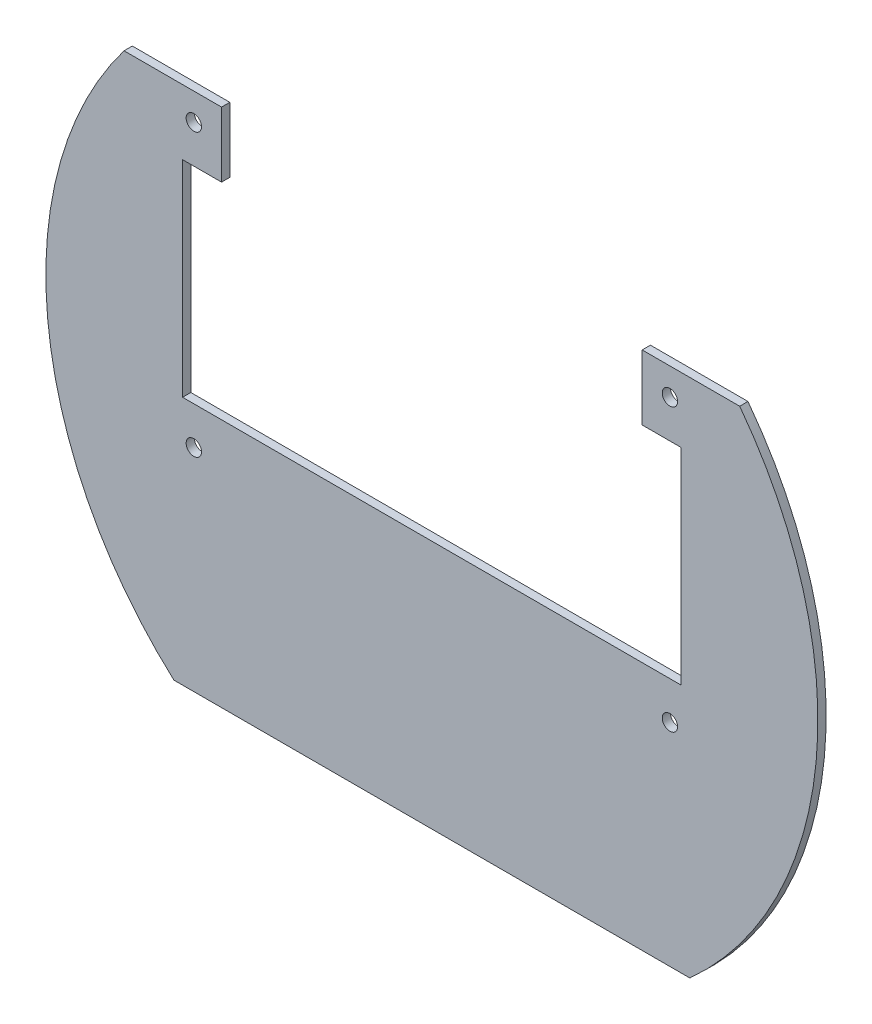
ISO-10303-21;
HEADER;
FILE_DESCRIPTION(('STEP AP214'),'2;1');
FILE_NAME('part.step','',(''),(''),'','','');
FILE_SCHEMA(('AUTOMOTIVE_DESIGN { 1 0 10303 214 1 1 1 1 }'));
ENDSEC;
DATA;
#1=APPLICATION_CONTEXT('core data for automotive mechanical design processes');
#2=APPLICATION_PROTOCOL_DEFINITION('international standard','automotive_design',2000,#1);
#3=PRODUCT_CONTEXT('',#1,'mechanical');
#4=PRODUCT('Part','Part','',(#3));
#5=PRODUCT_RELATED_PRODUCT_CATEGORY('part','',(#4));
#6=PRODUCT_DEFINITION_FORMATION('','',#4);
#7=PRODUCT_DEFINITION_CONTEXT('part definition',#1,'design');
#8=PRODUCT_DEFINITION('design','',#6,#7);
#9=PRODUCT_DEFINITION_SHAPE('','',#8);
#10=(LENGTH_UNIT() NAMED_UNIT(*) SI_UNIT(.MILLI.,.METRE.));
#11=(NAMED_UNIT(*) PLANE_ANGLE_UNIT() SI_UNIT($,.RADIAN.));
#12=(NAMED_UNIT(*) SI_UNIT($,.STERADIAN.) SOLID_ANGLE_UNIT());
#13=UNCERTAINTY_MEASURE_WITH_UNIT(LENGTH_MEASURE(1.E-05),#10,'distance_accuracy_value','');
#14=(GEOMETRIC_REPRESENTATION_CONTEXT(3) GLOBAL_UNCERTAINTY_ASSIGNED_CONTEXT((#13)) GLOBAL_UNIT_ASSIGNED_CONTEXT((#10,
#11,#12)) REPRESENTATION_CONTEXT('',''));
#15=CARTESIAN_POINT('',(0.,0.,0.));
#16=DIRECTION('',(0.,0.,1.));
#17=DIRECTION('',(1.,0.,0.));
#18=AXIS2_PLACEMENT_3D('',#15,#16,#17);
#19=CARTESIAN_POINT('',(0.,0.,1.6129));
#20=DIRECTION('',(0.,0.,1.));
#21=DIRECTION('',(1.,0.,0.));
#22=AXIS2_PLACEMENT_3D('',#19,#20,#21);
#23=PLANE('',#22);
#24=CARTESIAN_POINT('',(-46.5,-14.799999991,1.6129));
#25=DIRECTION('',(0.,0.,1.));
#26=DIRECTION('',(1.,0.,0.));
#27=AXIS2_PLACEMENT_3D('',#24,#25,#26);
#28=CIRCLE('',#27,1.5);
#29=CARTESIAN_POINT('',(-45.,-14.799999991,1.6129));
#30=VERTEX_POINT('',#29);
#31=EDGE_CURVE('E332',#30,#30,#28,.T.);
#32=ORIENTED_EDGE('',*,*,#31,.F.);
#33=EDGE_LOOP('',(#32));
#34=FACE_BOUND('',#33,.T.);
#35=CARTESIAN_POINT('',(46.5,-14.799999991,1.6129));
#36=DIRECTION('',(0.,0.,1.));
#37=DIRECTION('',(1.,0.,0.));
#38=AXIS2_PLACEMENT_3D('',#35,#36,#37);
#39=CIRCLE('',#38,1.5);
#40=CARTESIAN_POINT('',(48.,-14.799999991,1.6129));
#41=VERTEX_POINT('',#40);
#42=EDGE_CURVE('E170',#41,#41,#39,.T.);
#43=ORIENTED_EDGE('',*,*,#42,.F.);
#44=EDGE_LOOP('',(#43));
#45=FACE_BOUND('',#44,.T.);
#46=CARTESIAN_POINT('',(0.,0.,1.6129));
#47=DIRECTION('',(0.,0.,1.));
#48=DIRECTION('',(1.,0.,0.));
#49=AXIS2_PLACEMENT_3D('',#46,#47,#48);
#50=CIRCLE('',#49,75.40625);
#51=CARTESIAN_POINT('',(-60.1319593815344,45.5,1.6129));
#52=VERTEX_POINT('',#51);
#53=CARTESIAN_POINT('',(-50.3874244138605,-56.1,1.6129));
#54=VERTEX_POINT('',#53);
#55=EDGE_CURVE('E200',#52,#54,#50,.T.);
#56=ORIENTED_EDGE('',*,*,#55,.T.);
#57=DIRECTION('',(1.,0.,0.));
#58=VECTOR('',#57,1.);
#59=CARTESIAN_POINT('',(-50.3874244138605,-56.1,1.6129));
#60=LINE('',#59,#58);
#61=CARTESIAN_POINT('',(50.3874244138605,-56.1,1.6129));
#62=VERTEX_POINT('',#61);
#63=EDGE_CURVE('E112',#54,#62,#60,.T.);
#64=ORIENTED_EDGE('',*,*,#63,.T.);
#65=CARTESIAN_POINT('',(0.,0.,1.6129));
#66=DIRECTION('',(0.,0.,1.));
#67=DIRECTION('',(1.,0.,0.));
#68=AXIS2_PLACEMENT_3D('',#65,#66,#67);
#69=CIRCLE('',#68,75.40625);
#70=CARTESIAN_POINT('',(60.1319593815344,45.5,1.6129));
#71=VERTEX_POINT('',#70);
#72=EDGE_CURVE('E237',#62,#71,#69,.T.);
#73=ORIENTED_EDGE('',*,*,#72,.T.);
#74=DIRECTION('',(-1.,0.,0.));
#75=VECTOR('',#74,1.);
#76=CARTESIAN_POINT('',(41.08,45.5,1.6129));
#77=LINE('',#76,#75);
#78=CARTESIAN_POINT('',(41.08,45.5,1.6129));
#79=VERTEX_POINT('',#78);
#80=EDGE_CURVE('E257',#71,#79,#77,.T.);
#81=ORIENTED_EDGE('',*,*,#80,.T.);
#82=DIRECTION('',(0.,-1.,0.));
#83=VECTOR('',#82,1.);
#84=CARTESIAN_POINT('',(41.08,32.8,1.6129));
#85=LINE('',#84,#83);
#86=CARTESIAN_POINT('',(41.08,32.8,1.6129));
#87=VERTEX_POINT('',#86);
#88=EDGE_CURVE('E253',#79,#87,#85,.T.);
#89=ORIENTED_EDGE('',*,*,#88,.T.);
#90=DIRECTION('',(1.,0.,0.));
#91=VECTOR('',#90,1.);
#92=CARTESIAN_POINT('',(48.7,32.8,1.6129));
#93=LINE('',#92,#91);
#94=CARTESIAN_POINT('',(48.7,32.8,1.6129));
#95=VERTEX_POINT('',#94);
#96=EDGE_CURVE('E256',#87,#95,#93,.T.);
#97=ORIENTED_EDGE('',*,*,#96,.T.);
#98=DIRECTION('',(0.,-1.,0.));
#99=VECTOR('',#98,1.);
#100=CARTESIAN_POINT('',(48.7,-7.40000000000001,1.6129));
#101=LINE('',#100,#99);
#102=CARTESIAN_POINT('',(48.7,-7.40000000000001,1.6129));
#103=VERTEX_POINT('',#102);
#104=EDGE_CURVE('E261',#95,#103,#101,.T.);
#105=ORIENTED_EDGE('',*,*,#104,.T.);
#106=DIRECTION('',(-1.,0.,0.));
#107=VECTOR('',#106,1.);
#108=CARTESIAN_POINT('',(-48.7,-7.40000000000001,1.6129));
#109=LINE('',#108,#107);
#110=CARTESIAN_POINT('',(-48.7,-7.40000000000001,1.6129));
#111=VERTEX_POINT('',#110);
#112=EDGE_CURVE('E268',#103,#111,#109,.T.);
#113=ORIENTED_EDGE('',*,*,#112,.T.);
#114=DIRECTION('',(0.,1.,0.));
#115=VECTOR('',#114,1.);
#116=CARTESIAN_POINT('',(-48.7,32.8,1.6129));
#117=LINE('',#116,#115);
#118=CARTESIAN_POINT('',(-48.7,32.8,1.6129));
#119=VERTEX_POINT('',#118);
#120=EDGE_CURVE('E143',#111,#119,#117,.T.);
#121=ORIENTED_EDGE('',*,*,#120,.T.);
#122=DIRECTION('',(1.,0.,0.));
#123=VECTOR('',#122,1.);
#124=CARTESIAN_POINT('',(-48.7,32.8,1.6129));
#125=LINE('',#124,#123);
#126=CARTESIAN_POINT('',(-41.08,32.8,1.6129));
#127=VERTEX_POINT('',#126);
#128=EDGE_CURVE('E137',#119,#127,#125,.T.);
#129=ORIENTED_EDGE('',*,*,#128,.T.);
#130=DIRECTION('',(0.,1.,0.));
#131=VECTOR('',#130,1.);
#132=CARTESIAN_POINT('',(-41.08,32.8,1.6129));
#133=LINE('',#132,#131);
#134=CARTESIAN_POINT('',(-41.08,45.5,1.6129));
#135=VERTEX_POINT('',#134);
#136=EDGE_CURVE('E141',#127,#135,#133,.T.);
#137=ORIENTED_EDGE('',*,*,#136,.T.);
#138=DIRECTION('',(-1.,0.,0.));
#139=VECTOR('',#138,1.);
#140=CARTESIAN_POINT('',(-41.08,45.5,1.6129));
#141=LINE('',#140,#139);
#142=EDGE_CURVE('E57',#135,#52,#141,.T.);
#143=ORIENTED_EDGE('',*,*,#142,.T.);
#144=EDGE_LOOP('',(#56,#64,#73,#81,#89,#97,#105,#113,#121,#129,#137,#143));
#145=FACE_BOUND('',#144,.T.);
#146=CARTESIAN_POINT('',(-46.5,40.199999991,1.6129));
#147=DIRECTION('',(0.,0.,1.));
#148=DIRECTION('',(1.,0.,0.));
#149=AXIS2_PLACEMENT_3D('',#146,#147,#148);
#150=CIRCLE('',#149,1.5);
#151=CARTESIAN_POINT('',(-45.,40.199999991,1.6129));
#152=VERTEX_POINT('',#151);
#153=EDGE_CURVE('E340',#152,#152,#150,.T.);
#154=ORIENTED_EDGE('',*,*,#153,.F.);
#155=EDGE_LOOP('',(#154));
#156=FACE_BOUND('',#155,.T.);
#157=CARTESIAN_POINT('',(46.5,40.199999991,1.6129));
#158=DIRECTION('',(0.,0.,1.));
#159=DIRECTION('',(1.,0.,0.));
#160=AXIS2_PLACEMENT_3D('',#157,#158,#159);
#161=CIRCLE('',#160,1.5);
#162=CARTESIAN_POINT('',(48.,40.199999991,1.6129));
#163=VERTEX_POINT('',#162);
#164=EDGE_CURVE('E321',#163,#163,#161,.T.);
#165=ORIENTED_EDGE('',*,*,#164,.F.);
#166=EDGE_LOOP('',(#165));
#167=FACE_BOUND('',#166,.T.);
#168=ADVANCED_FACE('F39',(#34,#45,#145,#156,#167),#23,.T.);
#169=CARTESIAN_POINT('',(0.,0.,0.));
#170=DIRECTION('',(0.,0.,1.));
#171=DIRECTION('',(1.,0.,0.));
#172=AXIS2_PLACEMENT_3D('',#169,#170,#171);
#173=PLANE('',#172);
#174=CARTESIAN_POINT('',(0.,0.,0.));
#175=DIRECTION('',(0.,0.,1.));
#176=DIRECTION('',(1.,0.,0.));
#177=AXIS2_PLACEMENT_3D('',#174,#175,#176);
#178=CIRCLE('',#177,75.40625);
#179=CARTESIAN_POINT('',(-60.1319593815344,45.5,0.));
#180=VERTEX_POINT('',#179);
#181=CARTESIAN_POINT('',(-50.3874244138605,-56.1,0.));
#182=VERTEX_POINT('',#181);
#183=EDGE_CURVE('E165',#180,#182,#178,.T.);
#184=ORIENTED_EDGE('',*,*,#183,.F.);
#185=DIRECTION('',(-1.,0.,0.));
#186=VECTOR('',#185,1.);
#187=CARTESIAN_POINT('',(-41.08,45.5,0.));
#188=LINE('',#187,#186);
#189=CARTESIAN_POINT('',(-41.08,45.5,0.));
#190=VERTEX_POINT('',#189);
#191=EDGE_CURVE('E104',#190,#180,#188,.T.);
#192=ORIENTED_EDGE('',*,*,#191,.F.);
#193=DIRECTION('',(0.,1.,0.));
#194=VECTOR('',#193,1.);
#195=CARTESIAN_POINT('',(-41.08,32.8,0.));
#196=LINE('',#195,#194);
#197=CARTESIAN_POINT('',(-41.08,32.8,0.));
#198=VERTEX_POINT('',#197);
#199=EDGE_CURVE('E98',#198,#190,#196,.T.);
#200=ORIENTED_EDGE('',*,*,#199,.F.);
#201=DIRECTION('',(1.,0.,0.));
#202=VECTOR('',#201,1.);
#203=CARTESIAN_POINT('',(-48.7,32.8,0.));
#204=LINE('',#203,#202);
#205=CARTESIAN_POINT('',(-48.7,32.8,0.));
#206=VERTEX_POINT('',#205);
#207=EDGE_CURVE('E152',#206,#198,#204,.T.);
#208=ORIENTED_EDGE('',*,*,#207,.F.);
#209=DIRECTION('',(0.,1.,0.));
#210=VECTOR('',#209,1.);
#211=CARTESIAN_POINT('',(-48.7,32.8,0.));
#212=LINE('',#211,#210);
#213=CARTESIAN_POINT('',(-48.7,-7.40000000000001,0.));
#214=VERTEX_POINT('',#213);
#215=EDGE_CURVE('E191',#214,#206,#212,.T.);
#216=ORIENTED_EDGE('',*,*,#215,.F.);
#217=DIRECTION('',(-1.,0.,0.));
#218=VECTOR('',#217,1.);
#219=CARTESIAN_POINT('',(-48.7,-7.40000000000001,0.));
#220=LINE('',#219,#218);
#221=CARTESIAN_POINT('',(48.7,-7.40000000000001,0.));
#222=VERTEX_POINT('',#221);
#223=EDGE_CURVE('E188',#222,#214,#220,.T.);
#224=ORIENTED_EDGE('',*,*,#223,.F.);
#225=DIRECTION('',(0.,-1.,0.));
#226=VECTOR('',#225,1.);
#227=CARTESIAN_POINT('',(48.7,-7.40000000000001,0.));
#228=LINE('',#227,#226);
#229=CARTESIAN_POINT('',(48.7,32.8,0.));
#230=VERTEX_POINT('',#229);
#231=EDGE_CURVE('E185',#230,#222,#228,.T.);
#232=ORIENTED_EDGE('',*,*,#231,.F.);
#233=DIRECTION('',(1.,0.,0.));
#234=VECTOR('',#233,1.);
#235=CARTESIAN_POINT('',(48.7,32.8,0.));
#236=LINE('',#235,#234);
#237=CARTESIAN_POINT('',(41.08,32.8,0.));
#238=VERTEX_POINT('',#237);
#239=EDGE_CURVE('E182',#238,#230,#236,.T.);
#240=ORIENTED_EDGE('',*,*,#239,.F.);
#241=DIRECTION('',(0.,-1.,0.));
#242=VECTOR('',#241,1.);
#243=CARTESIAN_POINT('',(41.08,32.8,0.));
#244=LINE('',#243,#242);
#245=CARTESIAN_POINT('',(41.08,45.5,0.));
#246=VERTEX_POINT('',#245);
#247=EDGE_CURVE('E179',#246,#238,#244,.T.);
#248=ORIENTED_EDGE('',*,*,#247,.F.);
#249=DIRECTION('',(-1.,0.,0.));
#250=VECTOR('',#249,1.);
#251=CARTESIAN_POINT('',(41.08,45.5,0.));
#252=LINE('',#251,#250);
#253=CARTESIAN_POINT('',(60.1319593815344,45.5,0.));
#254=VERTEX_POINT('',#253);
#255=EDGE_CURVE('E176',#254,#246,#252,.T.);
#256=ORIENTED_EDGE('',*,*,#255,.F.);
#257=CARTESIAN_POINT('',(0.,0.,0.));
#258=DIRECTION('',(0.,0.,1.));
#259=DIRECTION('',(1.,0.,0.));
#260=AXIS2_PLACEMENT_3D('',#257,#258,#259);
#261=CIRCLE('',#260,75.40625);
#262=CARTESIAN_POINT('',(50.3874244138605,-56.1,0.));
#263=VERTEX_POINT('',#262);
#264=EDGE_CURVE('E173',#263,#254,#261,.T.);
#265=ORIENTED_EDGE('',*,*,#264,.F.);
#266=DIRECTION('',(1.,0.,0.));
#267=VECTOR('',#266,1.);
#268=CARTESIAN_POINT('',(-50.3874244138605,-56.1,0.));
#269=LINE('',#268,#267);
#270=EDGE_CURVE('E169',#182,#263,#269,.T.);
#271=ORIENTED_EDGE('',*,*,#270,.F.);
#272=EDGE_LOOP('',(#184,#192,#200,#208,#216,#224,#232,#240,#248,#256,#265,#271));
#273=FACE_BOUND('',#272,.T.);
#274=CARTESIAN_POINT('',(46.5,-14.799999991,0.));
#275=DIRECTION('',(0.,0.,1.));
#276=DIRECTION('',(1.,0.,0.));
#277=AXIS2_PLACEMENT_3D('',#274,#275,#276);
#278=CIRCLE('',#277,1.5);
#279=CARTESIAN_POINT('',(48.,-14.799999991,0.));
#280=VERTEX_POINT('',#279);
#281=EDGE_CURVE('E344',#280,#280,#278,.T.);
#282=ORIENTED_EDGE('',*,*,#281,.T.);
#283=EDGE_LOOP('',(#282));
#284=FACE_BOUND('',#283,.T.);
#285=CARTESIAN_POINT('',(-46.5,40.199999991,0.));
#286=DIRECTION('',(0.,0.,1.));
#287=DIRECTION('',(1.,0.,0.));
#288=AXIS2_PLACEMENT_3D('',#285,#286,#287);
#289=CIRCLE('',#288,1.5);
#290=CARTESIAN_POINT('',(-45.,40.199999991,0.));
#291=VERTEX_POINT('',#290);
#292=EDGE_CURVE('E336',#291,#291,#289,.T.);
#293=ORIENTED_EDGE('',*,*,#292,.T.);
#294=EDGE_LOOP('',(#293));
#295=FACE_BOUND('',#294,.T.);
#296=CARTESIAN_POINT('',(-46.5,-14.799999991,0.));
#297=DIRECTION('',(0.,0.,1.));
#298=DIRECTION('',(1.,0.,0.));
#299=AXIS2_PLACEMENT_3D('',#296,#297,#298);
#300=CIRCLE('',#299,1.5);
#301=CARTESIAN_POINT('',(-45.,-14.799999991,0.));
#302=VERTEX_POINT('',#301);
#303=EDGE_CURVE('E329',#302,#302,#300,.T.);
#304=ORIENTED_EDGE('',*,*,#303,.T.);
#305=EDGE_LOOP('',(#304));
#306=FACE_BOUND('',#305,.T.);
#307=CARTESIAN_POINT('',(46.5,40.199999991,0.));
#308=DIRECTION('',(0.,0.,1.));
#309=DIRECTION('',(1.,0.,0.));
#310=AXIS2_PLACEMENT_3D('',#307,#308,#309);
#311=CIRCLE('',#310,1.5);
#312=CARTESIAN_POINT('',(48.,40.199999991,0.));
#313=VERTEX_POINT('',#312);
#314=EDGE_CURVE('E324',#313,#313,#311,.T.);
#315=ORIENTED_EDGE('',*,*,#314,.T.);
#316=EDGE_LOOP('',(#315));
#317=FACE_BOUND('',#316,.T.);
#318=ADVANCED_FACE('F241',(#273,#284,#295,#306,#317),#173,.F.);
#319=CARTESIAN_POINT('',(0.,0.,1.6129));
#320=DIRECTION('',(0.,0.,-1.));
#321=DIRECTION('',(-1.,0.,0.));
#322=AXIS2_PLACEMENT_3D('',#319,#320,#321);
#323=CYLINDRICAL_SURFACE('',#322,75.40625);
#324=ORIENTED_EDGE('',*,*,#183,.T.);
#325=DIRECTION('',(0.,0.,-1.));
#326=VECTOR('',#325,1.);
#327=CARTESIAN_POINT('',(-50.3874244138605,-56.1,1.6129));
#328=LINE('',#327,#326);
#329=EDGE_CURVE('E11',#54,#182,#328,.T.);
#330=ORIENTED_EDGE('',*,*,#329,.F.);
#331=ORIENTED_EDGE('',*,*,#55,.F.);
#332=DIRECTION('',(0.,0.,-1.));
#333=VECTOR('',#332,1.);
#334=CARTESIAN_POINT('',(-60.1319593815344,45.5,1.6129));
#335=LINE('',#334,#333);
#336=EDGE_CURVE('E161',#52,#180,#335,.T.);
#337=ORIENTED_EDGE('',*,*,#336,.T.);
#338=EDGE_LOOP('',(#324,#330,#331,#337));
#339=FACE_BOUND('',#338,.T.);
#340=ADVANCED_FACE('F41',(#339),#323,.T.);
#341=CARTESIAN_POINT('',(-50.3874244138605,-56.1,1.6129));
#342=DIRECTION('',(0.,1.,0.));
#343=DIRECTION('',(0.,0.,1.));
#344=AXIS2_PLACEMENT_3D('',#341,#342,#343);
#345=PLANE('',#344);
#346=ORIENTED_EDGE('',*,*,#270,.T.);
#347=DIRECTION('',(0.,0.,-1.));
#348=VECTOR('',#347,1.);
#349=CARTESIAN_POINT('',(50.3874244138605,-56.1,1.6129));
#350=LINE('',#349,#348);
#351=EDGE_CURVE('E49',#62,#263,#350,.T.);
#352=ORIENTED_EDGE('',*,*,#351,.F.);
#353=ORIENTED_EDGE('',*,*,#63,.F.);
#354=ORIENTED_EDGE('',*,*,#329,.T.);
#355=EDGE_LOOP('',(#346,#352,#353,#354));
#356=FACE_BOUND('',#355,.T.);
#357=ADVANCED_FACE('F460',(#356),#345,.F.);
#358=CARTESIAN_POINT('',(0.,0.,1.6129));
#359=DIRECTION('',(0.,0.,-1.));
#360=DIRECTION('',(-1.,0.,0.));
#361=AXIS2_PLACEMENT_3D('',#358,#359,#360);
#362=CYLINDRICAL_SURFACE('',#361,75.40625);
#363=ORIENTED_EDGE('',*,*,#264,.T.);
#364=DIRECTION('',(0.,0.,-1.));
#365=VECTOR('',#364,1.);
#366=CARTESIAN_POINT('',(60.1319593815344,45.5,1.6129));
#367=LINE('',#366,#365);
#368=EDGE_CURVE('E227',#71,#254,#367,.T.);
#369=ORIENTED_EDGE('',*,*,#368,.F.);
#370=ORIENTED_EDGE('',*,*,#72,.F.);
#371=ORIENTED_EDGE('',*,*,#351,.T.);
#372=EDGE_LOOP('',(#363,#369,#370,#371));
#373=FACE_BOUND('',#372,.T.);
#374=ADVANCED_FACE('F235',(#373),#362,.T.);
#375=CARTESIAN_POINT('',(41.08,45.5,1.6129));
#376=DIRECTION('',(0.,-1.,0.));
#377=DIRECTION('',(0.,0.,-1.));
#378=AXIS2_PLACEMENT_3D('',#375,#376,#377);
#379=PLANE('',#378);
#380=ORIENTED_EDGE('',*,*,#255,.T.);
#381=DIRECTION('',(0.,0.,-1.));
#382=VECTOR('',#381,1.);
#383=CARTESIAN_POINT('',(41.08,45.5,1.6129));
#384=LINE('',#383,#382);
#385=EDGE_CURVE('E223',#79,#246,#384,.T.);
#386=ORIENTED_EDGE('',*,*,#385,.F.);
#387=ORIENTED_EDGE('',*,*,#80,.F.);
#388=ORIENTED_EDGE('',*,*,#368,.T.);
#389=EDGE_LOOP('',(#380,#386,#387,#388));
#390=FACE_BOUND('',#389,.T.);
#391=ADVANCED_FACE('F247',(#390),#379,.F.);
#392=CARTESIAN_POINT('',(41.08,32.8,1.6129));
#393=DIRECTION('',(1.,0.,0.));
#394=DIRECTION('',(0.,0.,-1.));
#395=AXIS2_PLACEMENT_3D('',#392,#393,#394);
#396=PLANE('',#395);
#397=ORIENTED_EDGE('',*,*,#247,.T.);
#398=DIRECTION('',(0.,0.,-1.));
#399=VECTOR('',#398,1.);
#400=CARTESIAN_POINT('',(41.08,32.8,1.6129));
#401=LINE('',#400,#399);
#402=EDGE_CURVE('E219',#87,#238,#401,.T.);
#403=ORIENTED_EDGE('',*,*,#402,.F.);
#404=ORIENTED_EDGE('',*,*,#88,.F.);
#405=ORIENTED_EDGE('',*,*,#385,.T.);
#406=EDGE_LOOP('',(#397,#403,#404,#405));
#407=FACE_BOUND('',#406,.T.);
#408=ADVANCED_FACE('F251',(#407),#396,.F.);
#409=CARTESIAN_POINT('',(48.7,32.8,1.6129));
#410=DIRECTION('',(0.,1.,0.));
#411=DIRECTION('',(0.,0.,1.));
#412=AXIS2_PLACEMENT_3D('',#409,#410,#411);
#413=PLANE('',#412);
#414=ORIENTED_EDGE('',*,*,#239,.T.);
#415=DIRECTION('',(0.,0.,-1.));
#416=VECTOR('',#415,1.);
#417=CARTESIAN_POINT('',(48.7,32.8,1.6129));
#418=LINE('',#417,#416);
#419=EDGE_CURVE('E215',#95,#230,#418,.T.);
#420=ORIENTED_EDGE('',*,*,#419,.F.);
#421=ORIENTED_EDGE('',*,*,#96,.F.);
#422=ORIENTED_EDGE('',*,*,#402,.T.);
#423=EDGE_LOOP('',(#414,#420,#421,#422));
#424=FACE_BOUND('',#423,.T.);
#425=ADVANCED_FACE('F425',(#424),#413,.F.);
#426=CARTESIAN_POINT('',(48.7,-7.40000000000001,1.6129));
#427=DIRECTION('',(1.,0.,0.));
#428=DIRECTION('',(0.,0.,-1.));
#429=AXIS2_PLACEMENT_3D('',#426,#427,#428);
#430=PLANE('',#429);
#431=ORIENTED_EDGE('',*,*,#231,.T.);
#432=DIRECTION('',(0.,0.,-1.));
#433=VECTOR('',#432,1.);
#434=CARTESIAN_POINT('',(48.7,-7.40000000000001,1.6129));
#435=LINE('',#434,#433);
#436=EDGE_CURVE('E211',#103,#222,#435,.T.);
#437=ORIENTED_EDGE('',*,*,#436,.F.);
#438=ORIENTED_EDGE('',*,*,#104,.F.);
#439=ORIENTED_EDGE('',*,*,#419,.T.);
#440=EDGE_LOOP('',(#431,#437,#438,#439));
#441=FACE_BOUND('',#440,.T.);
#442=ADVANCED_FACE('F416',(#441),#430,.F.);
#443=CARTESIAN_POINT('',(-48.7,-7.40000000000001,1.6129));
#444=DIRECTION('',(0.,-1.,0.));
#445=DIRECTION('',(0.,0.,-1.));
#446=AXIS2_PLACEMENT_3D('',#443,#444,#445);
#447=PLANE('',#446);
#448=ORIENTED_EDGE('',*,*,#223,.T.);
#449=DIRECTION('',(0.,0.,-1.));
#450=VECTOR('',#449,1.);
#451=CARTESIAN_POINT('',(-48.7,-7.40000000000001,1.6129));
#452=LINE('',#451,#450);
#453=EDGE_CURVE('E207',#111,#214,#452,.T.);
#454=ORIENTED_EDGE('',*,*,#453,.F.);
#455=ORIENTED_EDGE('',*,*,#112,.F.);
#456=ORIENTED_EDGE('',*,*,#436,.T.);
#457=EDGE_LOOP('',(#448,#454,#455,#456));
#458=FACE_BOUND('',#457,.T.);
#459=ADVANCED_FACE('F276',(#458),#447,.F.);
#460=CARTESIAN_POINT('',(-48.7,32.8,1.6129));
#461=DIRECTION('',(-1.,0.,0.));
#462=DIRECTION('',(0.,0.,1.));
#463=AXIS2_PLACEMENT_3D('',#460,#461,#462);
#464=PLANE('',#463);
#465=ORIENTED_EDGE('',*,*,#215,.T.);
#466=DIRECTION('',(0.,0.,-1.));
#467=VECTOR('',#466,1.);
#468=CARTESIAN_POINT('',(-48.7,32.8,1.6129));
#469=LINE('',#468,#467);
#470=EDGE_CURVE('E154',#119,#206,#469,.T.);
#471=ORIENTED_EDGE('',*,*,#470,.F.);
#472=ORIENTED_EDGE('',*,*,#120,.F.);
#473=ORIENTED_EDGE('',*,*,#453,.T.);
#474=EDGE_LOOP('',(#465,#471,#472,#473));
#475=FACE_BOUND('',#474,.T.);
#476=ADVANCED_FACE('F280',(#475),#464,.F.);
#477=CARTESIAN_POINT('',(-48.7,32.8,1.6129));
#478=DIRECTION('',(0.,1.,0.));
#479=DIRECTION('',(0.,0.,1.));
#480=AXIS2_PLACEMENT_3D('',#477,#478,#479);
#481=PLANE('',#480);
#482=ORIENTED_EDGE('',*,*,#207,.T.);
#483=DIRECTION('',(0.,0.,-1.));
#484=VECTOR('',#483,1.);
#485=CARTESIAN_POINT('',(-41.08,32.8,1.6129));
#486=LINE('',#485,#484);
#487=EDGE_CURVE('E149',#127,#198,#486,.T.);
#488=ORIENTED_EDGE('',*,*,#487,.F.);
#489=ORIENTED_EDGE('',*,*,#128,.F.);
#490=ORIENTED_EDGE('',*,*,#470,.T.);
#491=EDGE_LOOP('',(#482,#488,#489,#490));
#492=FACE_BOUND('',#491,.T.);
#493=ADVANCED_FACE('F150',(#492),#481,.F.);
#494=CARTESIAN_POINT('',(-41.08,32.8,1.6129));
#495=DIRECTION('',(-1.,0.,0.));
#496=DIRECTION('',(0.,0.,1.));
#497=AXIS2_PLACEMENT_3D('',#494,#495,#496);
#498=PLANE('',#497);
#499=ORIENTED_EDGE('',*,*,#199,.T.);
#500=DIRECTION('',(0.,0.,-1.));
#501=VECTOR('',#500,1.);
#502=CARTESIAN_POINT('',(-41.08,45.5,1.6129));
#503=LINE('',#502,#501);
#504=EDGE_CURVE('E155',#135,#190,#503,.T.);
#505=ORIENTED_EDGE('',*,*,#504,.F.);
#506=ORIENTED_EDGE('',*,*,#136,.F.);
#507=ORIENTED_EDGE('',*,*,#487,.T.);
#508=EDGE_LOOP('',(#499,#505,#506,#507));
#509=FACE_BOUND('',#508,.T.);
#510=ADVANCED_FACE('F157',(#509),#498,.F.);
#511=CARTESIAN_POINT('',(-41.08,45.5,1.6129));
#512=DIRECTION('',(0.,-1.,0.));
#513=DIRECTION('',(1.,0.,0.));
#514=AXIS2_PLACEMENT_3D('',#511,#512,#513);
#515=PLANE('',#514);
#516=ORIENTED_EDGE('',*,*,#191,.T.);
#517=ORIENTED_EDGE('',*,*,#336,.F.);
#518=ORIENTED_EDGE('',*,*,#142,.F.);
#519=ORIENTED_EDGE('',*,*,#504,.T.);
#520=EDGE_LOOP('',(#516,#517,#518,#519));
#521=FACE_BOUND('',#520,.T.);
#522=ADVANCED_FACE('F284',(#521),#515,.F.);
#523=CARTESIAN_POINT('',(46.5,-14.799999991,1.6129));
#524=DIRECTION('',(0.,0.,-1.));
#525=DIRECTION('',(-1.,0.,0.));
#526=AXIS2_PLACEMENT_3D('',#523,#524,#525);
#527=CYLINDRICAL_SURFACE('',#526,1.5);
#528=ORIENTED_EDGE('',*,*,#42,.T.);
#529=EDGE_LOOP('',(#528));
#530=FACE_BOUND('',#529,.T.);
#531=ORIENTED_EDGE('',*,*,#281,.F.);
#532=EDGE_LOOP('',(#531));
#533=FACE_BOUND('',#532,.T.);
#534=ADVANCED_FACE('F286',(#530,#533),#527,.F.);
#535=CARTESIAN_POINT('',(-46.5,40.199999991,1.6129));
#536=DIRECTION('',(0.,0.,-1.));
#537=DIRECTION('',(-1.,0.,0.));
#538=AXIS2_PLACEMENT_3D('',#535,#536,#537);
#539=CYLINDRICAL_SURFACE('',#538,1.5);
#540=ORIENTED_EDGE('',*,*,#153,.T.);
#541=EDGE_LOOP('',(#540));
#542=FACE_BOUND('',#541,.T.);
#543=ORIENTED_EDGE('',*,*,#292,.F.);
#544=EDGE_LOOP('',(#543));
#545=FACE_BOUND('',#544,.T.);
#546=ADVANCED_FACE('F292',(#542,#545),#539,.F.);
#547=CARTESIAN_POINT('',(-46.5,-14.799999991,1.6129));
#548=DIRECTION('',(0.,0.,-1.));
#549=DIRECTION('',(-1.,0.,0.));
#550=AXIS2_PLACEMENT_3D('',#547,#548,#549);
#551=CYLINDRICAL_SURFACE('',#550,1.5);
#552=ORIENTED_EDGE('',*,*,#31,.T.);
#553=EDGE_LOOP('',(#552));
#554=FACE_BOUND('',#553,.T.);
#555=ORIENTED_EDGE('',*,*,#303,.F.);
#556=EDGE_LOOP('',(#555));
#557=FACE_BOUND('',#556,.T.);
#558=ADVANCED_FACE('F308',(#554,#557),#551,.F.);
#559=CARTESIAN_POINT('',(46.5,40.199999991,1.6129));
#560=DIRECTION('',(0.,0.,-1.));
#561=DIRECTION('',(-1.,0.,0.));
#562=AXIS2_PLACEMENT_3D('',#559,#560,#561);
#563=CYLINDRICAL_SURFACE('',#562,1.5);
#564=ORIENTED_EDGE('',*,*,#164,.T.);
#565=EDGE_LOOP('',(#564));
#566=FACE_BOUND('',#565,.T.);
#567=ORIENTED_EDGE('',*,*,#314,.F.);
#568=EDGE_LOOP('',(#567));
#569=FACE_BOUND('',#568,.T.);
#570=ADVANCED_FACE('F312',(#566,#569),#563,.F.);
#571=CLOSED_SHELL('',(#168,#318,#340,#357,#374,#391,#408,#425,#442,#459,#476,#493,#510,#522,
#534,#546,#558,#570));
#572=MANIFOLD_SOLID_BREP('B2',#571);
#573=ADVANCED_BREP_SHAPE_REPRESENTATION('',(#18,#572),#14);
#574=SHAPE_DEFINITION_REPRESENTATION(#9,#573);
ENDSEC;
END-ISO-10303-21;
